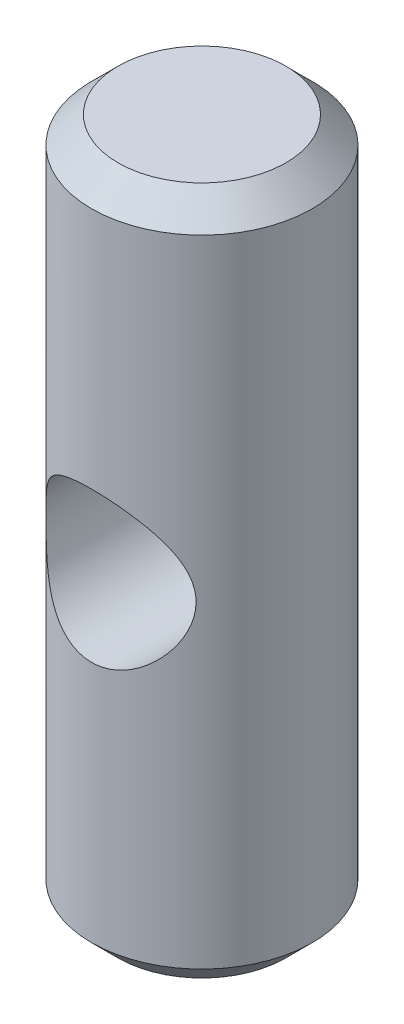
ISO-10303-21;
HEADER;
FILE_DESCRIPTION(('STEP AP214'),'2;1');
FILE_NAME('part.step','',(''),(''),'','','');
FILE_SCHEMA(('AUTOMOTIVE_DESIGN { 1 0 10303 214 1 1 1 1 }'));
ENDSEC;
DATA;
#1=APPLICATION_CONTEXT('core data for automotive mechanical design processes');
#2=APPLICATION_PROTOCOL_DEFINITION('international standard','automotive_design',2000,#1);
#3=PRODUCT_CONTEXT('',#1,'mechanical');
#4=PRODUCT('Part','Part','',(#3));
#5=PRODUCT_RELATED_PRODUCT_CATEGORY('part','',(#4));
#6=PRODUCT_DEFINITION_FORMATION('','',#4);
#7=PRODUCT_DEFINITION_CONTEXT('part definition',#1,'design');
#8=PRODUCT_DEFINITION('design','',#6,#7);
#9=PRODUCT_DEFINITION_SHAPE('','',#8);
#10=(LENGTH_UNIT() NAMED_UNIT(*) SI_UNIT(.MILLI.,.METRE.));
#11=(NAMED_UNIT(*) PLANE_ANGLE_UNIT() SI_UNIT($,.RADIAN.));
#12=(NAMED_UNIT(*) SI_UNIT($,.STERADIAN.) SOLID_ANGLE_UNIT());
#13=UNCERTAINTY_MEASURE_WITH_UNIT(LENGTH_MEASURE(1.E-05),#10,'distance_accuracy_value','');
#14=(GEOMETRIC_REPRESENTATION_CONTEXT(3) GLOBAL_UNCERTAINTY_ASSIGNED_CONTEXT((#13)) GLOBAL_UNIT_ASSIGNED_CONTEXT((#10,
#11,#12)) REPRESENTATION_CONTEXT('',''));
#15=CARTESIAN_POINT('',(0.,0.,0.));
#16=DIRECTION('',(0.,0.,1.));
#17=DIRECTION('',(1.,0.,0.));
#18=AXIS2_PLACEMENT_3D('',#15,#16,#17);
#19=CARTESIAN_POINT('',(0.,39.,0.));
#20=DIRECTION('',(0.,-1.,0.));
#21=DIRECTION('',(0.,0.,-1.));
#22=AXIS2_PLACEMENT_3D('',#19,#20,#21);
#23=CYLINDRICAL_SURFACE('',#22,12.5);
#24=CARTESIAN_POINT('',(0.,-36.,0.));
#25=DIRECTION('',(0.,1.,0.));
#26=DIRECTION('',(0.,0.,1.));
#27=AXIS2_PLACEMENT_3D('',#24,#25,#26);
#28=CIRCLE('',#27,12.5);
#29=CARTESIAN_POINT('',(0.,-36.,12.5));
#30=VERTEX_POINT('',#29);
#31=EDGE_CURVE('E25',#30,#30,#28,.T.);
#32=ORIENTED_EDGE('',*,*,#31,.T.);
#33=EDGE_LOOP('',(#32));
#34=FACE_BOUND('',#33,.T.);
#35=CARTESIAN_POINT('',(0.,36.,0.));
#36=DIRECTION('',(0.,1.,0.));
#37=DIRECTION('',(0.,0.,1.));
#38=AXIS2_PLACEMENT_3D('',#35,#36,#37);
#39=CIRCLE('',#38,12.5);
#40=CARTESIAN_POINT('',(0.,36.,12.5));
#41=VERTEX_POINT('',#40);
#42=EDGE_CURVE('E29',#41,#41,#39,.F.);
#43=ORIENTED_EDGE('',*,*,#42,.T.);
#44=EDGE_LOOP('',(#43));
#45=FACE_BOUND('',#44,.T.);
#46=CARTESIAN_POINT('',(0.,8.5,-12.5));
#47=CARTESIAN_POINT('',(-0.212611229406529,8.49999916390741,-12.4999992129301));
#48=CARTESIAN_POINT('',(-0.425235324985798,8.49201135696874,-12.4945635526216));
#49=CARTESIAN_POINT('',(-0.848748096912109,8.46018514502909,-12.4729546709161));
#50=CARTESIAN_POINT('',(-1.05963663672391,8.43634550481497,-12.4567806127574));
#51=CARTESIAN_POINT('',(-1.47813144874978,8.37316767042175,-12.4140805147799));
#52=CARTESIAN_POINT('',(-1.68573577573117,8.33382062424304,-12.3875485625085));
#53=CARTESIAN_POINT('',(-2.09603319242796,8.24020192526075,-12.3247605864052));
#54=CARTESIAN_POINT('',(-2.29872630768198,8.18593035008375,-12.2885046131505));
#55=CARTESIAN_POINT('',(-2.6968778205928,8.06349857846303,-12.2072897287299));
#56=CARTESIAN_POINT('',(-2.89236813271904,7.99541143656719,-12.1623766550361));
#57=CARTESIAN_POINT('',(-3.27622640483553,7.84594082403003,-12.0646421761312));
#58=CARTESIAN_POINT('',(-3.46459154778754,7.76455216072528,-12.0118176831271));
#59=CARTESIAN_POINT('',(-3.83321341938541,7.58934124360816,-11.8993103261073));
#60=CARTESIAN_POINT('',(-4.01347330451248,7.49552388714578,-11.8396301646949));
#61=CARTESIAN_POINT('',(-4.36534472829236,7.29621057492003,-11.7144651992292));
#62=CARTESIAN_POINT('',(-4.53695302658439,7.19071029003908,-11.6489782452681));
#63=CARTESIAN_POINT('',(-5.06667233733592,6.83873972145533,-11.4338002865402));
#64=CARTESIAN_POINT('',(-5.40791044131656,6.57183587234888,-11.275289082089));
#65=CARTESIAN_POINT('',(-6.04383553620056,5.99230020090763,-10.9476160988973));
#66=CARTESIAN_POINT('',(-6.3384531323822,5.67960152048925,-10.7784389576851));
#67=CARTESIAN_POINT('',(-6.76524031079195,5.15207751469636,-10.5126540168838));
#68=CARTESIAN_POINT('',(-6.91391766961813,4.95081833390408,-10.4152047270699));
#69=CARTESIAN_POINT('',(-7.19372836011809,4.53466127983461,-10.2239406887833));
#70=CARTESIAN_POINT('',(-7.32485747873144,4.31976014953013,-10.1301268169452));
#71=CARTESIAN_POINT('',(-7.56837784801758,3.87728453965254,-9.94950319761833));
#72=CARTESIAN_POINT('',(-7.68079896595189,3.6497310498191,-9.86268240232268));
#73=CARTESIAN_POINT('',(-7.88596866332237,3.1822339365503,-9.69941732082144));
#74=CARTESIAN_POINT('',(-7.9787168962926,2.94229009499671,-9.62297321737187));
#75=CARTESIAN_POINT('',(-8.1184983232508,2.52448279835234,-9.50503456510722));
#76=CARTESIAN_POINT('',(-8.17091788226446,2.34942992045086,-9.45991392681686));
#77=CARTESIAN_POINT('',(-8.26470838093257,1.99455320219841,-9.37808462233734));
#78=CARTESIAN_POINT('',(-8.30608643424035,1.81473251608635,-9.34137054227339));
#79=CARTESIAN_POINT('',(-8.37721986170618,1.45134940351047,-9.2776329492738));
#80=CARTESIAN_POINT('',(-8.40699037275046,1.26779218079922,-9.25059681954442));
#81=CARTESIAN_POINT('',(-8.45450274260778,0.897860127591477,-9.20719421658496));
#82=CARTESIAN_POINT('',(-8.47224456881084,0.711485289457777,-9.19082777228057));
#83=CARTESIAN_POINT('',(-8.49542774911737,0.336415887727097,-9.16940360323846));
#84=CARTESIAN_POINT('',(-8.50080981047673,0.147714490288373,-9.16440039189994));
#85=CARTESIAN_POINT('',(-8.49899309832957,-0.229574503370256,-9.16608517417559));
#86=CARTESIAN_POINT('',(-8.49179431975344,-0.418162099544272,-9.17277317250089));
#87=CARTESIAN_POINT('',(-8.46494901569467,-0.793801379472154,-9.19755223152106));
#88=CARTESIAN_POINT('',(-8.44529473460822,-0.98085203266486,-9.21565039688983));
#89=CARTESIAN_POINT('',(-8.3938913628403,-1.3519170463609,-9.26249376281584));
#90=CARTESIAN_POINT('',(-8.3621419958866,-1.53593133740841,-9.29123920657453));
#91=CARTESIAN_POINT('',(-8.28904286578348,-1.8901654020036,-9.35649660943276));
#92=CARTESIAN_POINT('',(-8.2482895562009,-2.06060006973876,-9.39251749110932));
#93=CARTESIAN_POINT('',(-8.15687607698334,-2.39703838226236,-9.47201379261136));
#94=CARTESIAN_POINT('',(-8.10621222038424,-2.56304035177817,-9.51549198599408));
#95=CARTESIAN_POINT('',(-7.94004717374606,-3.05365736865759,-9.6553911026255));
#96=CARTESIAN_POINT('',(-7.81036608355042,-3.37091404825548,-9.76128254981763));
#97=CARTESIAN_POINT('',(-7.5543637023359,-3.90455677210809,-9.95995741389655));
#98=CARTESIAN_POINT('',(-7.43561726211521,-4.12603609917096,-10.0491983821259));
#99=CARTESIAN_POINT('',(-7.18015660851212,-4.55608081630591,-10.2332855426676));
#100=CARTESIAN_POINT('',(-7.04343574552231,-4.76464138489007,-10.3281338022064));
#101=CARTESIAN_POINT('',(-6.75265789244995,-5.16852530921714,-10.5205544166205));
#102=CARTESIAN_POINT('',(-6.59857255721547,-5.36382616273829,-10.6181310241277));
#103=CARTESIAN_POINT('',(-6.27388868221983,-5.74021551780517,-10.8131484907168));
#104=CARTESIAN_POINT('',(-6.10329207879088,-5.92130568138705,-10.9105893643605));
#105=CARTESIAN_POINT('',(-5.74454430317503,-6.27003459745637,-11.1036963668885));
#106=CARTESIAN_POINT('',(-5.55625225597375,-6.43754140433818,-11.199339426626));
#107=CARTESIAN_POINT('',(-5.16396350310391,-6.75628192618958,-11.3855443251041));
#108=CARTESIAN_POINT('',(-4.9599654234511,-6.90751421466186,-11.4761057180928));
#109=CARTESIAN_POINT('',(-4.53740472159617,-7.19212977307886,-11.6496366590009));
#110=CARTESIAN_POINT('',(-4.31886875033327,-7.32554442533664,-11.7326194713579));
#111=CARTESIAN_POINT('',(-3.86797195499053,-7.5733024862078,-11.8888885095943));
#112=CARTESIAN_POINT('',(-3.63561531819141,-7.6876516316151,-11.9621776509134));
#113=CARTESIAN_POINT('',(-3.21144130470797,-7.87259042083719,-12.0819654469364));
#114=CARTESIAN_POINT('',(-3.022053266511,-7.94726158835923,-12.1308016584786));
#115=CARTESIAN_POINT('',(-2.6367008753895,-8.08328742186423,-12.2203482439586));
#116=CARTESIAN_POINT('',(-2.44073782030192,-8.14464469821701,-12.2610602106394));
#117=CARTESIAN_POINT('',(-2.04341856904868,-8.25329241278791,-12.3334989745208));
#118=CARTESIAN_POINT('',(-1.84206499338534,-8.30058955542913,-12.3652300538139));
#119=CARTESIAN_POINT('',(-1.43518188941922,-8.38052709990867,-12.4190321476114));
#120=CARTESIAN_POINT('',(-1.22965226709328,-8.41316717136179,-12.441102944363));
#121=CARTESIAN_POINT('',(-0.815207190454656,-8.46340091238258,-12.4751277150926));
#122=CARTESIAN_POINT('',(-0.606282567497378,-8.48094279501704,-12.4870468673847));
#123=CARTESIAN_POINT('',(-0.187370529507908,-8.5005210630142,-12.5003522522041));
#124=CARTESIAN_POINT('',(0.0226168846534609,-8.50255746107965,-12.5017384933603));
#125=CARTESIAN_POINT('',(0.441977632879436,-8.49109288060541,-12.4939441725854));
#126=CARTESIAN_POINT('',(0.651350937217888,-8.47759116198793,-12.4847631073353));
#127=CARTESIAN_POINT('',(1.06781626073916,-8.43525792222966,-12.4560561283182));
#128=CARTESIAN_POINT('',(1.27490833558741,-8.40642677599951,-12.4365304675482));
#129=CARTESIAN_POINT('',(1.67428781800202,-8.33580620011289,-12.3889073455685));
#130=CARTESIAN_POINT('',(1.86677484519456,-8.29479186339276,-12.3613238997183));
#131=CARTESIAN_POINT('',(2.24721772650369,-8.19990622798389,-12.2978542116027));
#132=CARTESIAN_POINT('',(2.43517201084202,-8.14603054360643,-12.2619651372658));
#133=CARTESIAN_POINT('',(2.80541670195474,-8.02605126266958,-12.1825890609117));
#134=CARTESIAN_POINT('',(2.98770864248847,-7.95995101171516,-12.1391041378977));
#135=CARTESIAN_POINT('',(3.34590416619503,-7.81614954581966,-12.0452988690557));
#136=CARTESIAN_POINT('',(3.52180537622698,-7.73844407503483,-11.9949760162485));
#137=CARTESIAN_POINT('',(3.88031205030355,-7.56544076962018,-11.8840705305856));
#138=CARTESIAN_POINT('',(4.06232426080535,-7.4692319439576,-11.822988789701));
#139=CARTESIAN_POINT('',(4.41740035751952,-7.26488731836294,-11.6949675512413));
#140=CARTESIAN_POINT('',(4.5904604253694,-7.15674648968412,-11.6280255863472));
#141=CARTESIAN_POINT('',(5.09553911437628,-6.81546087342391,-11.4200600711919));
#142=CARTESIAN_POINT('',(5.41350998148693,-6.56542673887321,-11.2718797237288));
#143=CARTESIAN_POINT('',(5.88447632341429,-6.1382424608712,-11.0300157872951));
#144=CARTESIAN_POINT('',(6.05109822364662,-5.97401067710243,-10.9392888561071));
#145=CARTESIAN_POINT('',(6.36999669503495,-5.6327287892332,-10.7567107993367));
#146=CARTESIAN_POINT('',(6.52227604622003,-5.45568118105035,-10.6648598955309));
#147=CARTESIAN_POINT('',(6.81208921698919,-5.0892087209444,-10.4821186841034));
#148=CARTESIAN_POINT('',(6.9496134269689,-4.899775930587,-10.3912290368342));
#149=CARTESIAN_POINT('',(7.2091725737248,-4.50919739117481,-10.212867133094));
#150=CARTESIAN_POINT('',(7.33120999976474,-4.30805353209668,-10.1253943289862));
#151=CARTESIAN_POINT('',(7.64131171747821,-3.74504307831762,-9.89544194142684));
#152=CARTESIAN_POINT('',(7.81365560029482,-3.37172386163579,-9.75870050072533));
#153=CARTESIAN_POINT('',(8.0318583969552,-2.78965723987428,-9.5785289780129));
#154=CARTESIAN_POINT('',(8.09785246373816,-2.59205087771646,-9.52264880061389));
#155=CARTESIAN_POINT('',(8.21569108391976,-2.19002993966032,-9.42117069089606));
#156=CARTESIAN_POINT('',(8.26753853402291,-1.98561676717834,-9.375570653917));
#157=CARTESIAN_POINT('',(8.34891457244461,-1.6053011127204,-9.30312255176955));
#158=CARTESIAN_POINT('',(8.38071060614132,-1.43023273327679,-9.27442445038085));
#159=CARTESIAN_POINT('',(8.43335759447562,-1.07717839228989,-9.22657851080832));
#160=CARTESIAN_POINT('',(8.45421074489629,-0.899193023462781,-9.20742875670543));
#161=CARTESIAN_POINT('',(8.48462590513332,-0.541575160788092,-9.17940927863587));
#162=CARTESIAN_POINT('',(8.49419587547127,-0.361943918418935,-9.17053230708616));
#163=CARTESIAN_POINT('',(8.50190326230583,-0.00221826905569432,-9.1633874625019));
#164=CARTESIAN_POINT('',(8.50004044888093,0.177876147180343,-9.16511980282826));
#165=CARTESIAN_POINT('',(8.48491973775006,0.5370556456046,-9.17911982332172));
#166=CARTESIAN_POINT('',(8.47166896204319,0.716141288232062,-9.19138091883147));
#167=CARTESIAN_POINT('',(8.43401190841614,1.07214121355693,-9.2259466375048));
#168=CARTESIAN_POINT('',(8.40960570874408,1.24905551147599,-9.24825119021997));
#169=CARTESIAN_POINT('',(8.34999087744399,1.59979027325011,-9.30211059217691));
#170=CARTESIAN_POINT('',(8.31477174417639,1.77360755484554,-9.33367443280799));
#171=CARTESIAN_POINT('',(8.23399688640742,2.11718373164182,-9.4050090004596));
#172=CARTESIAN_POINT('',(8.18843529403793,2.28694026227548,-9.44478438519404));
#173=CARTESIAN_POINT('',(8.07133858065294,2.67520382969941,-9.54521836203061));
#174=CARTESIAN_POINT('',(7.99615670437936,2.89194177930875,-9.60848763482577));
#175=CARTESIAN_POINT('',(7.82977778562174,3.31610119313206,-9.74454307136207));
#176=CARTESIAN_POINT('',(7.73857476504883,3.52351914329787,-9.81733278493736));
#177=CARTESIAN_POINT('',(7.54100901203986,3.92861609861968,-9.96989338780853));
#178=CARTESIAN_POINT('',(7.43462915211644,4.12628375644267,-10.0496721246119));
#179=CARTESIAN_POINT('',(7.20756400400657,4.5112031222072,-10.2137476160052));
#180=CARTESIAN_POINT('',(7.08687969143419,4.69845553922644,-10.2980440622568));
#181=CARTESIAN_POINT('',(6.82924274151674,5.06584454227427,-10.4707196427112));
#182=CARTESIAN_POINT('',(6.69201335046605,5.24576434327885,-10.5591466909608));
#183=CARTESIAN_POINT('',(6.40372122532589,5.59405742314174,-10.7364335060975));
#184=CARTESIAN_POINT('',(6.25265324016938,5.76242627624611,-10.8252934250271));
#185=CARTESIAN_POINT('',(5.93711876139708,6.08702343879609,-11.0015125380574));
#186=CARTESIAN_POINT('',(5.77265023699961,6.24324990109032,-11.0888715022582));
#187=CARTESIAN_POINT('',(5.43075906662422,6.54282142578617,-11.2602586816036));
#188=CARTESIAN_POINT('',(5.25333683727211,6.68616690214426,-11.3442870037365));
#189=CARTESIAN_POINT('',(4.86280344788978,6.97635617744866,-11.5175664782056));
#190=CARTESIAN_POINT('',(4.64801393352486,7.12135889779645,-11.6061386832676));
#191=CARTESIAN_POINT('',(4.20346535730454,7.39247293121866,-11.7744368948176));
#192=CARTESIAN_POINT('',(3.97370392709394,7.51858124499237,-11.854161496316));
#193=CARTESIAN_POINT('',(3.50095025371568,7.74999907866131,-12.0022746388594));
#194=CARTESIAN_POINT('',(3.25798165837102,7.85534430590749,-12.0706826085549));
#195=CARTESIAN_POINT('',(2.76031494250418,8.04371560633565,-12.1941088824536));
#196=CARTESIAN_POINT('',(2.50562230406701,8.12675198927174,-12.2491333705489));
#197=CARTESIAN_POINT('',(2.06534954894267,8.24739792519664,-12.329567052311));
#198=CARTESIAN_POINT('',(1.88214205575194,8.29115225681945,-12.3589009427645));
#199=CARTESIAN_POINT('',(1.51217598659128,8.36653680966855,-12.4095993153829));
#200=CARTESIAN_POINT('',(1.32541809579886,8.39816934579647,-12.4309653191557));
#201=CARTESIAN_POINT('',(0.949520469364701,8.4489269775882,-12.4653126060539));
#202=CARTESIAN_POINT('',(0.760381715142795,8.46805706525246,-12.4782972356842));
#203=CARTESIAN_POINT('',(0.380832179850983,8.49359470711208,-12.495641797779));
#204=CARTESIAN_POINT('',(0.190421250259459,8.50000074883061,-12.5000007049244));
#205=CARTESIAN_POINT('',(0.,8.5,-12.5));
#206=B_SPLINE_CURVE_WITH_KNOTS('',3,(#46,#47,#48,#49,#50,#51,#52,#53,#54,#55,#56,#57,#58,#59,
#60,#61,#62,#63,#64,#65,#66,#67,#68,#69,#70,#71,#72,#73,#74,#75,#76,#77,#78,#79,#80,#81,#82,#83,
#84,#85,#86,#87,#88,#89,#90,#91,#92,#93,#94,#95,#96,#97,#98,#99,#100,#101,#102,#103,#104,#105,
#106,#107,#108,#109,#110,#111,#112,#113,#114,#115,#116,#117,#118,#119,#120,#121,#122,#123,#124,
#125,#126,#127,#128,#129,#130,#131,#132,#133,#134,#135,#136,#137,#138,#139,#140,#141,#142,#143,
#144,#145,#146,#147,#148,#149,#150,#151,#152,#153,#154,#155,#156,#157,#158,#159,#160,#161,#162,
#163,#164,#165,#166,#167,#168,#169,#170,#171,#172,#173,#174,#175,#176,#177,#178,#179,#180,#181,
#182,#183,#184,#185,#186,#187,#188,#189,#190,#191,#192,#193,#194,#195,#196,#197,#198,#199,#200,
#201,#202,#203,#204,#205),.UNSPECIFIED.,.T.,.F.,(4,2,2,2,2,2,2,2,2,2,2,2,2,2,2,2,2,2,2,2,2,2,2,
2,2,2,2,2,2,2,2,2,2,2,2,2,2,2,2,2,2,2,2,2,2,2,2,2,2,2,2,2,2,2,2,2,2,2,2,2,2,2,2,2,2,2,2,2,2,2,2,
2,2,2,2,2,2,2,2,4),(0.,0.637638569316176,1.27532683079304,1.91337962848085,2.55142910754344,
3.18618871327802,3.82119671172004,4.45595523440743,5.09094975939609,6.46937914241849,
7.84984140223583,8.65461300195753,9.45957746955409,10.2632442217744,11.0669251264715,
11.6310837059482,12.1948779355317,12.7579344669572,13.3209925248329,13.8867461142772,
14.4524999316996,15.0186063707375,15.5847257413799,16.1209085432474,16.6572911988076,
17.729962068664,18.5291174726279,19.3285693591328,20.129345680615,20.9300282058792,
21.7377350551793,22.5455126441933,23.351848178703,24.1579406479864,24.7853694223414,
25.4126750693585,26.0396811108585,26.6667012849986,27.2958636699022,27.9250255393692,
28.5542173769459,29.1833938271328,29.7789366809116,30.3746829041909,30.9702663249758,
31.566068695707,32.2096414263224,32.8534864344468,34.1409914628099,34.893197555009,
35.6452575450771,36.3978043947685,37.1502301304353,38.4443718771902,39.0908409976289,
39.7371776455615,40.2773148354423,40.8173436006944,41.3569911358348,41.8966495237114,
42.4359706561683,42.9752880056927,43.5151308120085,44.0552806709294,44.7681537714426,
45.4812934388263,46.1952443656952,46.9091466265849,47.6373057820495,48.3657423918077,
49.0942895983837,49.8228133832457,50.6432675911966,51.463851900488,52.2830124533647,
53.1017937876742,53.673152307973,54.2444016613844,54.8154227857347,55.3865117819358),.UNSPECIFIED.);
#207=CARTESIAN_POINT('',(0.,8.5,-12.5));
#208=VERTEX_POINT('',#207);
#209=EDGE_CURVE('E34',#208,#208,#206,.T.);
#210=ORIENTED_EDGE('',*,*,#209,.T.);
#211=EDGE_LOOP('',(#210));
#212=FACE_BOUND('',#211,.T.);
#213=CARTESIAN_POINT('',(8.5,0.,9.16515138991168));
#214=CARTESIAN_POINT('',(8.49999848103352,-0.206088728048638,9.16515435137744));
#215=CARTESIAN_POINT('',(8.49248800048587,-0.412212060655004,9.17213583057471));
#216=CARTESIAN_POINT('',(8.46261532781039,-0.822482695778841,9.1997032500682));
#217=CARTESIAN_POINT('',(8.44024911507194,-1.02662944816771,9.22029287331568));
#218=CARTESIAN_POINT('',(8.3811034442874,-1.43143853036613,9.27408730137549));
#219=CARTESIAN_POINT('',(8.34430186283791,-1.63209501573087,9.3073114672796));
#220=CARTESIAN_POINT('',(8.25695470058673,-2.02827116070182,9.38488691971489));
#221=CARTESIAN_POINT('',(8.20640187372764,-2.22378805232506,9.42924407168693));
#222=CARTESIAN_POINT('',(8.0929293785794,-2.60651269076972,9.52680514030859));
#223=CARTESIAN_POINT('',(8.03014703841639,-2.7937867192509,9.57990988979939));
#224=CARTESIAN_POINT('',(7.89263199756951,-3.16147211352694,9.69352020888648));
#225=CARTESIAN_POINT('',(7.81790087738243,-3.34188438304342,9.7540247994377));
#226=CARTESIAN_POINT('',(7.5766884397089,-3.87228632386059,9.94412008782076));
#227=CARTESIAN_POINT('',(7.39312795371831,-4.21164033238037,10.0823463734539));
#228=CARTESIAN_POINT('',(7.0702508993189,-4.72346898058283,10.3093525360843));
#229=CARTESIAN_POINT('',(6.94452130536774,-4.90639680333772,10.3946444109643));
#230=CARTESIAN_POINT('',(6.67951741016981,-5.26147264248068,10.5668815131737));
#231=CARTESIAN_POINT('',(6.54024093789126,-5.43361892372062,10.6538270037107));
#232=CARTESIAN_POINT('',(6.24847211705666,-5.76677475148638,10.8275327870459));
#233=CARTESIAN_POINT('',(6.09596586520745,-5.92777225428573,10.9142927843839));
#234=CARTESIAN_POINT('',(5.77824797680767,-6.23787798047955,11.0857764344671));
#235=CARTESIAN_POINT('',(5.61303651934248,-6.38698637139588,11.170500115893));
#236=CARTESIAN_POINT('',(5.24396777814774,-6.69455134158231,11.3489649684113));
#237=CARTESIAN_POINT('',(5.03807127007633,-6.85092906699646,11.4420938236212));
#238=CARTESIAN_POINT('',(4.61060952227589,-7.1456047526604,11.6209276386172));
#239=CARTESIAN_POINT('',(4.38904162928076,-7.2838996400245,11.7066313357849));
#240=CARTESIAN_POINT('',(3.93167037859807,-7.54059872775555,11.8680532183401));
#241=CARTESIAN_POINT('',(3.69588915266799,-7.65903281886527,11.9437863719154));
#242=CARTESIAN_POINT('',(3.21133572211425,-7.8744872130227,12.0830786875566));
#243=CARTESIAN_POINT('',(2.96256879539231,-7.97151613345675,12.1466427473417));
#244=CARTESIAN_POINT('',(2.51940835104151,-8.12048949225855,12.2450026092391));
#245=CARTESIAN_POINT('',(2.32744758813441,-8.17761353995428,12.2829947849229));
#246=CARTESIAN_POINT('',(1.93855933051281,-8.27842440905489,12.3503400478085));
#247=CARTESIAN_POINT('',(1.74163284484189,-8.32211393694643,12.3796948750187));
#248=CARTESIAN_POINT('',(1.34415899673727,-8.39547825599371,12.4291319561483));
#249=CARTESIAN_POINT('',(1.14361390688543,-8.42516154578204,12.4492198328542));
#250=CARTESIAN_POINT('',(0.740172438537701,-8.47014398577306,12.4797061168245));
#251=CARTESIAN_POINT('',(0.537275982330194,-8.48544265919019,12.4901042029156));
#252=CARTESIAN_POINT('',(0.130292677784315,-8.50144499579772,12.5009812517459));
#253=CARTESIAN_POINT('',(-0.073795613094346,-8.50212364913506,12.5014432171794));
#254=CARTESIAN_POINT('',(-0.481268456170128,-8.48881228385607,12.4923941008278));
#255=CARTESIAN_POINT('',(-0.684653010975164,-8.47482231965742,12.4828830560406));
#256=CARTESIAN_POINT('',(-1.08925251926926,-8.43237316575784,12.4541027119486));
#257=CARTESIAN_POINT('',(-1.29046693379804,-8.40391046253482,12.4348310430782));
#258=CARTESIAN_POINT('',(-1.68926040926245,-8.33291196470857,12.3869582752026));
#259=CARTESIAN_POINT('',(-1.88683945822216,-8.29037612375324,12.3583571454694));
#260=CARTESIAN_POINT('',(-2.27341125751405,-8.19271606831157,12.2930591969054));
#261=CARTESIAN_POINT('',(-2.46249567210535,-8.13784446889485,12.2565252803728));
#262=CARTESIAN_POINT('',(-2.83498515320652,-8.01569065240001,12.1757627196494));
#263=CARTESIAN_POINT('',(-3.01838819594679,-7.94840407100619,12.1315313698437));
#264=CARTESIAN_POINT('',(-3.37855314009499,-7.8021242233848,12.0361979722602));
#265=CARTESIAN_POINT('',(-3.55531685315285,-7.72313418015828,11.9850978164322));
#266=CARTESIAN_POINT('',(-3.90160552151597,-7.55411389413234,11.8768867769885));
#267=CARTESIAN_POINT('',(-4.07112783111474,-7.46407966198256,11.8197737224727));
#268=CARTESIAN_POINT('',(-4.60515263764892,-7.15702515533222,11.6273640591456));
#269=CARTESIAN_POINT('',(-4.95443467378754,-6.91941946360894,11.4819087248686));
#270=CARTESIAN_POINT('',(-5.61048966004968,-6.39907800227535,11.1760341307864));
#271=CARTESIAN_POINT('',(-5.91721289759742,-6.11629027143199,11.0155977314986));
#272=CARTESIAN_POINT('',(-6.36728205780274,-5.63619465118874,10.7584574722756));
#273=CARTESIAN_POINT('',(-6.52562305429753,-5.45208481303523,10.6629213780352));
#274=CARTESIAN_POINT('',(-6.82630605473487,-5.07055692129286,10.4729720040763));
#275=CARTESIAN_POINT('',(-6.96864485838239,-4.87313621823486,10.3785589523202));
#276=CARTESIAN_POINT('',(-7.23654495126266,-4.46563149875463,10.1935722563913));
#277=CARTESIAN_POINT('',(-7.36211199511762,-4.25555186187497,10.1029973026346));
#278=CARTESIAN_POINT('',(-7.59563797334545,-3.82316808017901,9.92862060231437));
#279=CARTESIAN_POINT('',(-7.70360245559496,-3.60086781664319,9.84481672589768));
#280=CARTESIAN_POINT('',(-7.87744955410163,-3.19871149281721,9.70593012274128));
#281=CARTESIAN_POINT('',(-7.94724371410613,-3.02126590529237,9.64874475825135));
#282=CARTESIAN_POINT('',(-8.07530611883444,-2.66009809103174,9.54182315551202));
#283=CARTESIAN_POINT('',(-8.13357730307947,-2.476377479121,9.49208501825664));
#284=CARTESIAN_POINT('',(-8.23787325719613,-2.10353590742439,9.40171308048351));
#285=CARTESIAN_POINT('',(-8.28391305254534,-1.91442189246215,9.36106811936883));
#286=CARTESIAN_POINT('',(-8.36314474689064,-1.53165800275521,9.29035184375983));
#287=CARTESIAN_POINT('',(-8.39634341794788,-1.33801057611303,9.26027495671817));
#288=CARTESIAN_POINT('',(-8.44956721836601,-0.945692041994092,9.21173887830028));
#289=CARTESIAN_POINT('',(-8.46947419807787,-0.746991763222282,9.19338394417147));
#290=CARTESIAN_POINT('',(-8.49523044262475,-0.347903872938088,9.16958957563399));
#291=CARTESIAN_POINT('',(-8.50107999980425,-0.147516296602473,9.1641498726344));
#292=CARTESIAN_POINT('',(-8.49859215529454,0.253093847137905,9.16645695363142));
#293=CARTESIAN_POINT('',(-8.49025465520225,0.453316413388501,9.17420382909166));
#294=CARTESIAN_POINT('',(-8.45957672496459,0.851756835090894,9.20249925457852));
#295=CARTESIAN_POINT('',(-8.43723660531876,1.04997473489591,9.22304752074205));
#296=CARTESIAN_POINT('',(-8.38234977035324,1.4202539438099,9.27293958236994));
#297=CARTESIAN_POINT('',(-8.35126652077466,1.59270907583355,9.30100519977012));
#298=CARTESIAN_POINT('',(-8.27891598055431,1.93390828312786,9.36546286410257));
#299=CARTESIAN_POINT('',(-8.23764498671888,2.102650984603,9.40185793839909));
#300=CARTESIAN_POINT('',(-8.09920438866342,2.60235745564956,9.52196552448908));
#301=CARTESIAN_POINT('',(-7.98740749031454,2.92679747092542,9.61660009122972));
#302=CARTESIAN_POINT('',(-7.76406944710815,3.46846651899267,9.79713340382955));
#303=CARTESIAN_POINT('',(-7.66076855638965,3.6908092868739,9.87837957197693));
#304=CARTESIAN_POINT('',(-7.43668030925491,4.1237308603243,10.0481614663021));
#305=CARTESIAN_POINT('',(-7.31588641170573,4.33430522435024,10.1366999139061));
#306=CARTESIAN_POINT('',(-7.057555110513,4.74336953550824,10.3182305157256));
#307=CARTESIAN_POINT('',(-6.9199913389539,4.94183969620749,10.4112295405373));
#308=CARTESIAN_POINT('',(-6.6289650617256,5.32586600935381,10.5989056436404));
#309=CARTESIAN_POINT('',(-6.47550429941205,5.51142357414732,10.6935825369852));
#310=CARTESIAN_POINT('',(-6.15090881561908,5.87162099499198,10.8835743426256));
#311=CARTESIAN_POINT('',(-5.97955300749704,6.04606711246697,10.9788790600963));
#312=CARTESIAN_POINT('',(-5.62152225032707,6.38031823732258,11.1664376651947));
#313=CARTESIAN_POINT('',(-5.43484617075649,6.54012216237286,11.2586913269709));
#314=CARTESIAN_POINT('',(-5.04701734410803,6.84384351968125,11.4377960077872));
#315=CARTESIAN_POINT('',(-4.84588487373397,6.98778251264816,11.5246542873473));
#316=CARTESIAN_POINT('',(-4.42966325122995,7.25876819250256,11.6909483753739));
#317=CARTESIAN_POINT('',(-4.21457708638763,7.38581847738029,11.7703857637206));
#318=CARTESIAN_POINT('',(-3.8103676814612,7.60091562227886,11.9066482210212));
#319=CARTESIAN_POINT('',(-3.62331315699271,7.69189434623213,11.9649950072684));
#320=CARTESIAN_POINT('',(-3.24118379552441,7.86055502982749,12.0741123304867));
#321=CARTESIAN_POINT('',(-3.04611042740105,7.93823941135962,12.1248842471893));
#322=CARTESIAN_POINT('',(-2.64898456574907,8.07943498400338,12.2177921267493));
#323=CARTESIAN_POINT('',(-2.44693506262307,8.14295216304681,12.2599317375339));
#324=CARTESIAN_POINT('',(-2.03698952979335,8.25504833242398,12.3346697076918));
#325=CARTESIAN_POINT('',(-1.82909342825783,8.30362713913604,12.3672679497829));
#326=CARTESIAN_POINT('',(-1.40786635197289,8.3853540295442,12.4222881658997));
#327=CARTESIAN_POINT('',(-1.19451359000307,8.41842464178954,12.444659035257));
#328=CARTESIAN_POINT('',(-0.765042387357295,8.46826065674087,12.4784254522543));
#329=CARTESIAN_POINT('',(-0.548923940486887,8.48502602292071,12.4898209753078));
#330=CARTESIAN_POINT('',(-0.115773629314078,8.50197421680752,12.5013410054429));
#331=CARTESIAN_POINT('',(0.10125807148212,8.50215989629495,12.5014674508564));
#332=CARTESIAN_POINT('',(0.534404324530495,8.48595163262076,12.4904499089418));
#333=CARTESIAN_POINT('',(0.750518927113385,8.46955861143739,12.4793065483525));
#334=CARTESIAN_POINT('',(1.16241743812833,8.42248049955046,12.4474056750359));
#335=CARTESIAN_POINT('',(1.35841686789453,8.39307583105218,12.4275102687628));
#336=CARTESIAN_POINT('',(1.74688971829355,8.32090248080877,12.3788814682301));
#337=CARTESIAN_POINT('',(1.93936192547817,8.27812928806603,12.3501450907756));
#338=CARTESIAN_POINT('',(2.31949660045235,8.17976012888763,12.2844266338982));
#339=CARTESIAN_POINT('',(2.50716024813584,8.12416734217823,12.2474465992782));
#340=CARTESIAN_POINT('',(2.87680266763823,8.00074950507985,12.1659297205088));
#341=CARTESIAN_POINT('',(3.05877922007526,7.93291974747031,12.1213899687392));
#342=CARTESIAN_POINT('',(3.42502338753252,7.78205387199988,12.0231826731012));
#343=CARTESIAN_POINT('',(3.60895648656006,7.69843014276207,11.9691718279184));
#344=CARTESIAN_POINT('',(3.96887157093934,7.51920837118769,11.8546927188142));
#345=CARTESIAN_POINT('',(4.14485064361239,7.42360598997063,11.7942221162301));
#346=CARTESIAN_POINT('',(4.48818758741185,7.22121052996686,11.6678888493749));
#347=CARTESIAN_POINT('',(4.65554628513358,7.11441852712762,11.6020267036652));
#348=CARTESIAN_POINT('',(4.98122598477095,6.89031710836147,11.4659732144009));
#349=CARTESIAN_POINT('',(5.13954593071523,6.7730064676709,11.3957813670045));
#350=CARTESIAN_POINT('',(5.47100763974769,6.50920384126855,11.2408452514058));
#351=CARTESIAN_POINT('',(5.64255328442261,6.36102654779215,11.1555508703671));
#352=CARTESIAN_POINT('',(5.97261424917882,6.05218750694922,10.9823777402567));
#353=CARTESIAN_POINT('',(6.13112820936108,5.89152446004779,10.8944987227656));
#354=CARTESIAN_POINT('',(6.43506912146338,5.55795958578322,10.7177821560741));
#355=CARTESIAN_POINT('',(6.5804647014258,5.3850300987681,10.6289428498397));
#356=CARTESIAN_POINT('',(6.85726418389389,5.02781977083319,10.4525049753565));
#357=CARTESIAN_POINT('',(6.98867228429584,4.84354236198784,10.3649060417307));
#358=CARTESIAN_POINT('',(7.25348598690173,4.43879738884499,10.1816587502149));
#359=CARTESIAN_POINT('',(7.38484786897896,4.21677037158985,10.086482378698));
#360=CARTESIAN_POINT('',(7.62800421325966,3.75908521680873,9.90387210550152));
#361=CARTESIAN_POINT('',(7.73979297035631,3.52342313152185,9.81644046488626));
#362=CARTESIAN_POINT('',(7.94202112916635,3.04016642034811,9.65355456916812));
#363=CARTESIAN_POINT('',(8.03253732346736,2.79261872514166,9.57805756441742));
#364=CARTESIAN_POINT('',(8.19100322537332,2.28642961869638,9.44289751453995));
#365=CARTESIAN_POINT('',(8.25897325314606,2.02779843540385,9.38322022139061));
#366=CARTESIAN_POINT('',(8.37565430688358,1.47786933164728,9.27928856466895));
#367=CARTESIAN_POINT('',(8.42210570039203,1.18571576706158,9.2368855183936));
#368=CARTESIAN_POINT('',(8.46874460583983,0.743269543733732,9.19406014455721));
#369=CARTESIAN_POINT('',(8.48045122910269,0.595069265834194,9.18324817593681));
#370=CARTESIAN_POINT('',(8.49607882508031,0.297918599201243,9.16879332688934));
#371=CARTESIAN_POINT('',(8.50000109796357,0.148968339899435,9.16514924925779));
#372=CARTESIAN_POINT('',(8.5,0.,9.16515138991168));
#373=B_SPLINE_CURVE_WITH_KNOTS('',3,(#213,#214,#215,#216,#217,#218,#219,#220,#221,#222,#223,
#224,#225,#226,#227,#228,#229,#230,#231,#232,#233,#234,#235,#236,#237,#238,#239,#240,#241,#242,
#243,#244,#245,#246,#247,#248,#249,#250,#251,#252,#253,#254,#255,#256,#257,#258,#259,#260,#261,
#262,#263,#264,#265,#266,#267,#268,#269,#270,#271,#272,#273,#274,#275,#276,#277,#278,#279,#280,
#281,#282,#283,#284,#285,#286,#287,#288,#289,#290,#291,#292,#293,#294,#295,#296,#297,#298,#299,
#300,#301,#302,#303,#304,#305,#306,#307,#308,#309,#310,#311,#312,#313,#314,#315,#316,#317,#318,
#319,#320,#321,#322,#323,#324,#325,#326,#327,#328,#329,#330,#331,#332,#333,#334,#335,#336,#337,
#338,#339,#340,#341,#342,#343,#344,#345,#346,#347,#348,#349,#350,#351,#352,#353,#354,#355,#356,
#357,#358,#359,#360,#361,#362,#363,#364,#365,#366,#367,#368,#369,#370,#371,#372),.UNSPECIFIED.,
.T.,.F.,(4,2,2,2,2,2,2,2,2,2,2,2,2,2,2,2,2,2,2,2,2,2,2,2,2,2,2,2,2,2,2,2,2,2,2,2,2,2,2,2,2,2,2,
2,2,2,2,2,2,2,2,2,2,2,2,2,2,2,2,2,2,2,2,2,2,2,2,2,2,2,2,2,2,2,2,2,2,2,2,4),(0.,
0.618076514819962,1.23632037636507,1.85551547358185,2.47503748256103,3.08796676955052,
3.70081504972688,4.92587263263931,5.63876070411443,6.35176321234118,7.06552431523269,
7.77927535919547,8.6025964278708,9.42605722530915,10.2482673598117,11.0701458788783,
11.6810712732917,12.2918735113613,12.9023046519005,13.5127560247829,14.1242515883692,
14.7357448834351,15.3473867006089,15.9590305323418,16.559135815319,17.1594524603585,
17.7596040912055,18.3599731490311,19.6949262927931,21.0314258879502,21.813555274241,
22.5958408021788,23.377857223846,24.1596266955044,24.7563236570903,25.3528682038333,
25.9486765093684,26.5441701719309,27.1448890966779,27.7455955284966,28.3463061269019,
28.9470034053872,29.4788453537582,30.0108809094049,31.074958458916,31.8489288494065,
32.6231894003245,33.3986834449898,34.1740925343604,34.9605742309322,35.7471140163071,
36.5325713465697,37.3178610729758,37.9653245056952,38.6126698612417,39.2597410881232,
39.9068202684523,40.5570983861097,41.2073779604824,41.8575456836366,42.5076772515132,
43.1045651992386,43.7016547752325,44.2985964102589,44.8957681635704,45.5225771067661,
46.1496137512243,46.7765901576819,47.4036396627282,48.1295072357719,48.8554504595842,
49.5830861114968,50.3105027673523,51.1343321664247,51.9584012941395,52.7794482507793,
53.5997531995794,54.4932533016083,54.9400958609379,55.3868637808302),.UNSPECIFIED.);
#374=CARTESIAN_POINT('',(8.5,0.,9.16515138991168));
#375=VERTEX_POINT('',#374);
#376=EDGE_CURVE('E42',#375,#375,#373,.T.);
#377=ORIENTED_EDGE('',*,*,#376,.T.);
#378=EDGE_LOOP('',(#377));
#379=FACE_BOUND('',#378,.T.);
#380=ADVANCED_FACE('F14',(#34,#45,#212,#379),#23,.T.);
#381=CARTESIAN_POINT('',(0.,39.,0.));
#382=DIRECTION('',(0.,1.,0.));
#383=DIRECTION('',(0.,0.,1.));
#384=AXIS2_PLACEMENT_3D('',#381,#382,#383);
#385=PLANE('',#384);
#386=CARTESIAN_POINT('',(0.,39.,0.));
#387=DIRECTION('',(0.,1.,0.));
#388=DIRECTION('',(0.,0.,1.));
#389=AXIS2_PLACEMENT_3D('',#386,#387,#388);
#390=CIRCLE('',#389,9.5);
#391=CARTESIAN_POINT('',(0.,39.,9.5));
#392=VERTEX_POINT('',#391);
#393=EDGE_CURVE('E10',#392,#392,#390,.T.);
#394=ORIENTED_EDGE('',*,*,#393,.T.);
#395=EDGE_LOOP('',(#394));
#396=FACE_BOUND('',#395,.T.);
#397=ADVANCED_FACE('F55',(#396),#385,.T.);
#398=CARTESIAN_POINT('',(0.,-39.,0.));
#399=DIRECTION('',(0.,1.,0.));
#400=DIRECTION('',(0.,0.,1.));
#401=AXIS2_PLACEMENT_3D('',#398,#399,#400);
#402=PLANE('',#401);
#403=CARTESIAN_POINT('',(0.,-39.,0.));
#404=DIRECTION('',(0.,1.,0.));
#405=DIRECTION('',(0.,0.,1.));
#406=AXIS2_PLACEMENT_3D('',#403,#404,#405);
#407=CIRCLE('',#406,9.5);
#408=CARTESIAN_POINT('',(0.,-39.,9.5));
#409=VERTEX_POINT('',#408);
#410=EDGE_CURVE('E21',#409,#409,#407,.F.);
#411=ORIENTED_EDGE('',*,*,#410,.T.);
#412=EDGE_LOOP('',(#411));
#413=FACE_BOUND('',#412,.T.);
#414=ADVANCED_FACE('F53',(#413),#402,.F.);
#415=CARTESIAN_POINT('',(0.,0.,-12.5));
#416=DIRECTION('',(0.,0.,1.));
#417=DIRECTION('',(1.,0.,0.));
#418=AXIS2_PLACEMENT_3D('',#415,#416,#417);
#419=CYLINDRICAL_SURFACE('',#418,8.5);
#420=ORIENTED_EDGE('',*,*,#376,.F.);
#421=EDGE_LOOP('',(#420));
#422=FACE_BOUND('',#421,.T.);
#423=ORIENTED_EDGE('',*,*,#209,.F.);
#424=EDGE_LOOP('',(#423));
#425=FACE_BOUND('',#424,.T.);
#426=ADVANCED_FACE('F48',(#422,#425),#419,.F.);
#427=CARTESIAN_POINT('',(0.,-36.,0.));
#428=DIRECTION('',(0.,1.,0.));
#429=DIRECTION('',(0.,0.,1.));
#430=AXIS2_PLACEMENT_3D('',#427,#428,#429);
#431=CONICAL_SURFACE('',#430,12.5,0.785398163397452);
#432=ORIENTED_EDGE('',*,*,#410,.F.);
#433=EDGE_LOOP('',(#432));
#434=FACE_BOUND('',#433,.T.);
#435=ORIENTED_EDGE('',*,*,#31,.F.);
#436=EDGE_LOOP('',(#435));
#437=FACE_BOUND('',#436,.T.);
#438=ADVANCED_FACE('F52',(#434,#437),#431,.T.);
#439=CARTESIAN_POINT('',(0.,39.,0.));
#440=DIRECTION('',(0.,-1.,0.));
#441=DIRECTION('',(0.,0.,-1.));
#442=AXIS2_PLACEMENT_3D('',#439,#440,#441);
#443=CONICAL_SURFACE('',#442,9.5,0.785398163397446);
#444=ORIENTED_EDGE('',*,*,#42,.F.);
#445=EDGE_LOOP('',(#444));
#446=FACE_BOUND('',#445,.T.);
#447=ORIENTED_EDGE('',*,*,#393,.F.);
#448=EDGE_LOOP('',(#447));
#449=FACE_BOUND('',#448,.T.);
#450=ADVANCED_FACE('F16',(#446,#449),#443,.T.);
#451=CLOSED_SHELL('',(#380,#397,#414,#426,#438,#450));
#452=MANIFOLD_SOLID_BREP('B1',#451);
#453=ADVANCED_BREP_SHAPE_REPRESENTATION('',(#18,#452),#14);
#454=SHAPE_DEFINITION_REPRESENTATION(#9,#453);
ENDSEC;
END-ISO-10303-21;
